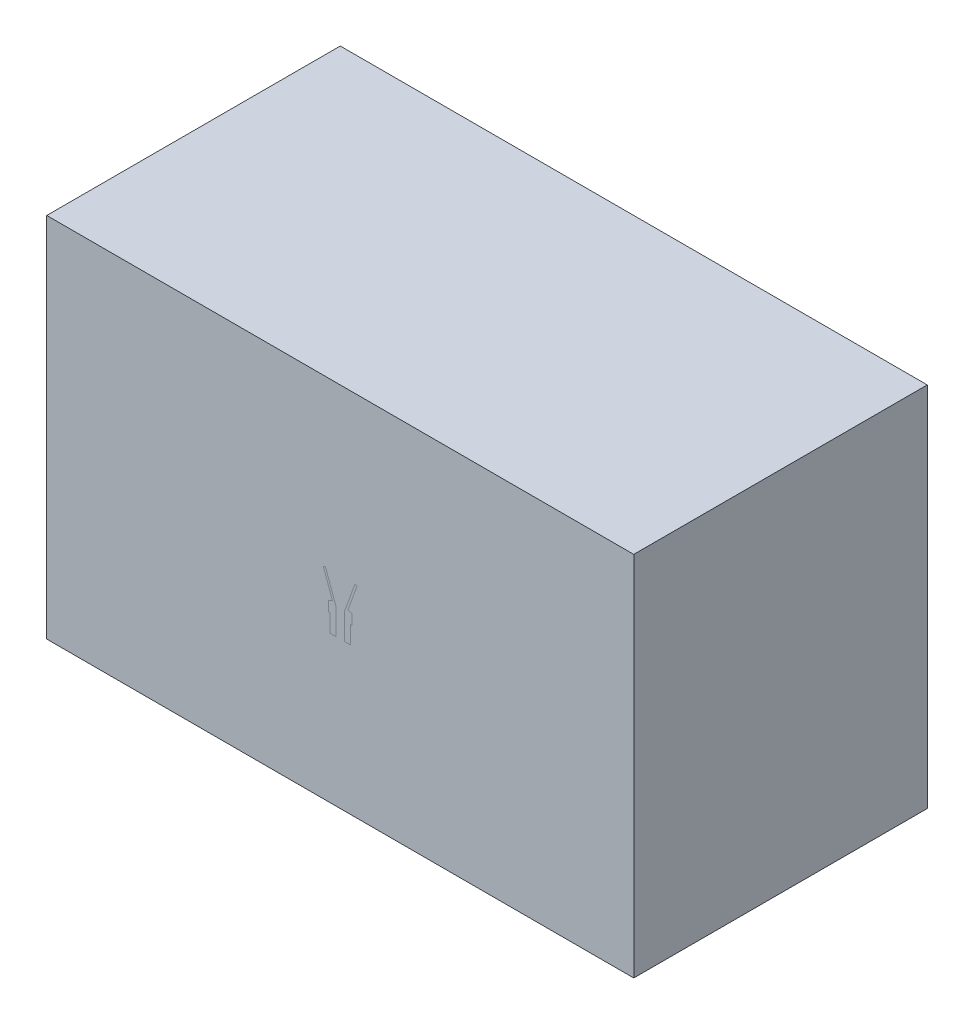
ISO-10303-21;
HEADER;
FILE_DESCRIPTION(('STEP AP214'),'2;1');
FILE_NAME('part.step','',(''),(''),'','','');
FILE_SCHEMA(('AUTOMOTIVE_DESIGN { 1 0 10303 214 1 1 1 1 }'));
ENDSEC;
DATA;
#1=APPLICATION_CONTEXT('core data for automotive mechanical design processes');
#2=APPLICATION_PROTOCOL_DEFINITION('international standard','automotive_design',2000,#1);
#3=PRODUCT_CONTEXT('',#1,'mechanical');
#4=PRODUCT('Part','Part','',(#3));
#5=PRODUCT_RELATED_PRODUCT_CATEGORY('part','',(#4));
#6=PRODUCT_DEFINITION_FORMATION('','',#4);
#7=PRODUCT_DEFINITION_CONTEXT('part definition',#1,'design');
#8=PRODUCT_DEFINITION('design','',#6,#7);
#9=PRODUCT_DEFINITION_SHAPE('','',#8);
#10=(LENGTH_UNIT() NAMED_UNIT(*) SI_UNIT(.MILLI.,.METRE.));
#11=(NAMED_UNIT(*) PLANE_ANGLE_UNIT() SI_UNIT($,.RADIAN.));
#12=(NAMED_UNIT(*) SI_UNIT($,.STERADIAN.) SOLID_ANGLE_UNIT());
#13=UNCERTAINTY_MEASURE_WITH_UNIT(LENGTH_MEASURE(1.E-05),#10,'distance_accuracy_value','');
#14=(GEOMETRIC_REPRESENTATION_CONTEXT(3) GLOBAL_UNCERTAINTY_ASSIGNED_CONTEXT((#13)) GLOBAL_UNIT_ASSIGNED_CONTEXT((#10,
#11,#12)) REPRESENTATION_CONTEXT('',''));
#15=CARTESIAN_POINT('',(0.,0.,0.));
#16=DIRECTION('',(0.,0.,1.));
#17=DIRECTION('',(1.,0.,0.));
#18=AXIS2_PLACEMENT_3D('',#15,#16,#17);
#19=CARTESIAN_POINT('',(0.,457.,0.));
#20=DIRECTION('',(0.,1.,0.));
#21=DIRECTION('',(0.,0.,1.));
#22=AXIS2_PLACEMENT_3D('',#19,#20,#21);
#23=CONICAL_SURFACE('',#22,75.,0.349065850398861);
#24=DIRECTION('',(0.342020143325664,0.93969262078591,0.));
#25=VECTOR('',#24,1.);
#26=CARTESIAN_POINT('',(0.,250.9391935409,0.));
#27=LINE('',#26,#25);
#28=CARTESIAN_POINT('',(257.433544449909,958.232043927204,0.));
#29=VERTEX_POINT('',#28);
#30=CARTESIAN_POINT('',(75.,457.,0.));
#31=VERTEX_POINT('',#30);
#32=EDGE_CURVE('E171',#29,#31,#27,.F.);
#33=ORIENTED_EDGE('',*,*,#32,.F.);
#34=CARTESIAN_POINT('',(0.,958.232043927204,0.));
#35=DIRECTION('',(0.,-1.,0.));
#36=DIRECTION('',(0.,0.,-1.));
#37=AXIS2_PLACEMENT_3D('',#34,#35,#36);
#38=CIRCLE('',#37,257.433544449909);
#39=CARTESIAN_POINT('',(-257.433544449909,958.232043927204,0.));
#40=VERTEX_POINT('',#39);
#41=EDGE_CURVE('E155',#40,#29,#38,.T.);
#42=ORIENTED_EDGE('',*,*,#41,.F.);
#43=DIRECTION('',(0.342020143325664,-0.93969262078591,0.));
#44=VECTOR('',#43,1.);
#45=CARTESIAN_POINT('',(0.,250.9391935409,0.));
#46=LINE('',#45,#44);
#47=CARTESIAN_POINT('',(-75.,457.,0.));
#48=VERTEX_POINT('',#47);
#49=EDGE_CURVE('E136',#48,#40,#46,.F.);
#50=ORIENTED_EDGE('',*,*,#49,.F.);
#51=CARTESIAN_POINT('',(0.,457.,0.));
#52=DIRECTION('',(0.,-1.,0.));
#53=DIRECTION('',(0.,0.,-1.));
#54=AXIS2_PLACEMENT_3D('',#51,#52,#53);
#55=CIRCLE('',#54,75.);
#56=EDGE_CURVE('E124',#48,#31,#55,.T.);
#57=ORIENTED_EDGE('',*,*,#56,.T.);
#58=EDGE_LOOP('',(#33,#42,#50,#57));
#59=FACE_BOUND('',#58,.T.);
#60=ADVANCED_FACE('F49',(#59),#23,.F.);
#61=CARTESIAN_POINT('',(0.,958.232043927204,0.));
#62=DIRECTION('',(0.,-1.,0.));
#63=DIRECTION('',(0.,0.,-1.));
#64=AXIS2_PLACEMENT_3D('',#61,#62,#63);
#65=CONICAL_SURFACE('',#64,257.433544449909,1.22173047639604);
#66=DIRECTION('',(-0.93969262078591,-0.342020143325664,0.));
#67=VECTOR('',#66,1.);
#68=CARTESIAN_POINT('',(0.,1051.93019140862,0.));
#69=LINE('',#68,#67);
#70=CARTESIAN_POINT('',(-293.235833301852,945.201076466497,0.));
#71=VERTEX_POINT('',#70);
#72=EDGE_CURVE('E140',#40,#71,#69,.T.);
#73=ORIENTED_EDGE('',*,*,#72,.F.);
#74=ORIENTED_EDGE('',*,*,#41,.T.);
#75=DIRECTION('',(-0.93969262078591,0.342020143325664,0.));
#76=VECTOR('',#75,1.);
#77=CARTESIAN_POINT('',(0.,1051.93019140862,0.));
#78=LINE('',#77,#76);
#79=CARTESIAN_POINT('',(293.235833301852,945.201076466497,0.));
#80=VERTEX_POINT('',#79);
#81=EDGE_CURVE('E173',#80,#29,#78,.T.);
#82=ORIENTED_EDGE('',*,*,#81,.F.);
#83=CARTESIAN_POINT('',(0.,945.201076466497,0.));
#84=DIRECTION('',(0.,-1.,0.));
#85=DIRECTION('',(0.,0.,-1.));
#86=AXIS2_PLACEMENT_3D('',#83,#84,#85);
#87=CIRCLE('',#86,293.235833301852);
#88=EDGE_CURVE('E152',#71,#80,#87,.T.);
#89=ORIENTED_EDGE('',*,*,#88,.F.);
#90=EDGE_LOOP('',(#73,#74,#82,#89));
#91=FACE_BOUND('',#90,.T.);
#92=ADVANCED_FACE('F199',(#91),#65,.T.);
#93=CARTESIAN_POINT('',(0.,945.201076466497,0.));
#94=DIRECTION('',(0.,1.,0.));
#95=DIRECTION('',(0.,0.,1.));
#96=AXIS2_PLACEMENT_3D('',#93,#94,#95);
#97=CONICAL_SURFACE('',#96,293.235833301852,0.34906585039886);
#98=DIRECTION('',(0.342020143325663,0.93969262078591,0.));
#99=VECTOR('',#98,1.);
#100=CARTESIAN_POINT('',(0.,139.542245894684,0.));
#101=LINE('',#100,#99);
#102=CARTESIAN_POINT('',(133.634704911401,506.700580094249,0.));
#103=VERTEX_POINT('',#102);
#104=EDGE_CURVE('E175',#103,#80,#101,.T.);
#105=ORIENTED_EDGE('',*,*,#104,.F.);
#106=CARTESIAN_POINT('',(0.,506.700580094249,0.));
#107=DIRECTION('',(0.,-1.,0.));
#108=DIRECTION('',(0.,0.,-1.));
#109=AXIS2_PLACEMENT_3D('',#106,#107,#108);
#110=CIRCLE('',#109,133.634704911402);
#111=CARTESIAN_POINT('',(-133.634704911401,506.700580094249,0.));
#112=VERTEX_POINT('',#111);
#113=EDGE_CURVE('E149',#112,#103,#110,.T.);
#114=ORIENTED_EDGE('',*,*,#113,.F.);
#115=DIRECTION('',(0.342020143325663,-0.93969262078591,0.));
#116=VECTOR('',#115,1.);
#117=CARTESIAN_POINT('',(0.,139.542245894684,0.));
#118=LINE('',#117,#116);
#119=EDGE_CURVE('E161',#71,#112,#118,.T.);
#120=ORIENTED_EDGE('',*,*,#119,.F.);
#121=ORIENTED_EDGE('',*,*,#88,.T.);
#122=EDGE_LOOP('',(#105,#114,#120,#121));
#123=FACE_BOUND('',#122,.T.);
#124=ADVANCED_FACE('F205',(#123),#97,.T.);
#125=CARTESIAN_POINT('',(0.,506.700580094249,0.));
#126=DIRECTION('',(0.,-1.,0.));
#127=DIRECTION('',(0.,0.,-1.));
#128=AXIS2_PLACEMENT_3D('',#125,#126,#127);
#129=CONICAL_SURFACE('',#128,133.634704911402,1.22173047639604);
#130=DIRECTION('',(-0.93969262078591,-0.342020143325663,0.));
#131=VECTOR('',#130,1.);
#132=CARTESIAN_POINT('',(0.,555.339634946945,0.));
#133=LINE('',#132,#131);
#134=CARTESIAN_POINT('',(-200.4,482.4,0.));
#135=VERTEX_POINT('',#134);
#136=EDGE_CURVE('E163',#112,#135,#133,.T.);
#137=ORIENTED_EDGE('',*,*,#136,.F.);
#138=ORIENTED_EDGE('',*,*,#113,.T.);
#139=DIRECTION('',(-0.93969262078591,0.342020143325663,0.));
#140=VECTOR('',#139,1.);
#141=CARTESIAN_POINT('',(0.,555.339634946945,0.));
#142=LINE('',#141,#140);
#143=CARTESIAN_POINT('',(200.4,482.4,0.));
#144=VERTEX_POINT('',#143);
#145=EDGE_CURVE('E177',#144,#103,#142,.T.);
#146=ORIENTED_EDGE('',*,*,#145,.F.);
#147=CARTESIAN_POINT('',(0.,482.4,0.));
#148=DIRECTION('',(0.,-1.,0.));
#149=DIRECTION('',(0.,0.,-1.));
#150=AXIS2_PLACEMENT_3D('',#147,#148,#149);
#151=CIRCLE('',#150,200.4);
#152=EDGE_CURVE('E146',#135,#144,#151,.T.);
#153=ORIENTED_EDGE('',*,*,#152,.F.);
#154=EDGE_LOOP('',(#137,#138,#146,#153));
#155=FACE_BOUND('',#154,.T.);
#156=ADVANCED_FACE('F213',(#155),#129,.T.);
#157=CARTESIAN_POINT('',(0.,0.,0.));
#158=DIRECTION('',(0.,-1.,0.));
#159=DIRECTION('',(0.,0.,-1.));
#160=AXIS2_PLACEMENT_3D('',#157,#158,#159);
#161=CYLINDRICAL_SURFACE('',#160,200.4);
#162=DIRECTION('',(0.,-1.,0.));
#163=VECTOR('',#162,1.);
#164=CARTESIAN_POINT('',(-200.4,0.,0.));
#165=LINE('',#164,#163);
#166=CARTESIAN_POINT('',(-200.4,307.,0.));
#167=VERTEX_POINT('',#166);
#168=EDGE_CURVE('E165',#135,#167,#165,.T.);
#169=ORIENTED_EDGE('',*,*,#168,.F.);
#170=ORIENTED_EDGE('',*,*,#152,.T.);
#171=DIRECTION('',(0.,-1.,0.));
#172=VECTOR('',#171,1.);
#173=CARTESIAN_POINT('',(200.4,0.,0.));
#174=LINE('',#173,#172);
#175=CARTESIAN_POINT('',(200.4,307.,0.));
#176=VERTEX_POINT('',#175);
#177=EDGE_CURVE('E131',#176,#144,#174,.F.);
#178=ORIENTED_EDGE('',*,*,#177,.F.);
#179=CARTESIAN_POINT('',(0.,307.,0.));
#180=DIRECTION('',(0.,-1.,0.));
#181=DIRECTION('',(0.,0.,-1.));
#182=AXIS2_PLACEMENT_3D('',#179,#180,#181);
#183=CIRCLE('',#182,200.4);
#184=EDGE_CURVE('E130',#167,#176,#183,.T.);
#185=ORIENTED_EDGE('',*,*,#184,.F.);
#186=EDGE_LOOP('',(#169,#170,#178,#185));
#187=FACE_BOUND('',#186,.T.);
#188=ADVANCED_FACE('F217',(#187),#161,.T.);
#189=CARTESIAN_POINT('',(-175.,307.,0.));
#190=DIRECTION('',(0.,1.,0.));
#191=DIRECTION('',(0.,0.,1.));
#192=AXIS2_PLACEMENT_3D('',#189,#190,#191);
#193=PLANE('',#192);
#194=DIRECTION('',(1.,0.,0.));
#195=VECTOR('',#194,1.);
#196=CARTESIAN_POINT('',(-175.,307.,0.));
#197=LINE('',#196,#195);
#198=CARTESIAN_POINT('',(-175.,307.,0.));
#199=VERTEX_POINT('',#198);
#200=EDGE_CURVE('E71',#167,#199,#197,.T.);
#201=ORIENTED_EDGE('',*,*,#200,.F.);
#202=ORIENTED_EDGE('',*,*,#184,.T.);
#203=CARTESIAN_POINT('',(175.,307.,0.));
#204=VERTEX_POINT('',#203);
#205=EDGE_CURVE('E118',#204,#176,#197,.T.);
#206=ORIENTED_EDGE('',*,*,#205,.F.);
#207=CARTESIAN_POINT('',(0.,307.,0.));
#208=DIRECTION('',(0.,1.,0.));
#209=DIRECTION('',(0.,0.,1.));
#210=AXIS2_PLACEMENT_3D('',#207,#208,#209);
#211=CIRCLE('',#210,175.);
#212=EDGE_CURVE('E128',#204,#199,#211,.T.);
#213=ORIENTED_EDGE('',*,*,#212,.T.);
#214=EDGE_LOOP('',(#201,#202,#206,#213));
#215=FACE_BOUND('',#214,.T.);
#216=ADVANCED_FACE('F51',(#215),#193,.F.);
#217=CARTESIAN_POINT('',(0.,457.,0.));
#218=DIRECTION('',(0.,-1.,0.));
#219=DIRECTION('',(0.,0.,-1.));
#220=AXIS2_PLACEMENT_3D('',#217,#218,#219);
#221=CYLINDRICAL_SURFACE('',#220,75.);
#222=ORIENTED_EDGE('',*,*,#56,.F.);
#223=DIRECTION('',(0.,-1.,0.));
#224=VECTOR('',#223,1.);
#225=CARTESIAN_POINT('',(-75.,457.,0.));
#226=LINE('',#225,#224);
#227=CARTESIAN_POINT('',(-75.,0.,0.));
#228=VERTEX_POINT('',#227);
#229=EDGE_CURVE('E167',#48,#228,#226,.T.);
#230=ORIENTED_EDGE('',*,*,#229,.T.);
#231=CARTESIAN_POINT('',(0.,0.,0.));
#232=DIRECTION('',(0.,1.,0.));
#233=DIRECTION('',(0.,0.,1.));
#234=AXIS2_PLACEMENT_3D('',#231,#232,#233);
#235=CIRCLE('',#234,75.);
#236=CARTESIAN_POINT('',(75.,0.,0.));
#237=VERTEX_POINT('',#236);
#238=EDGE_CURVE('E138',#237,#228,#235,.T.);
#239=ORIENTED_EDGE('',*,*,#238,.F.);
#240=DIRECTION('',(0.,-1.,0.));
#241=VECTOR('',#240,1.);
#242=CARTESIAN_POINT('',(75.,457.,0.));
#243=LINE('',#242,#241);
#244=EDGE_CURVE('E132',#237,#31,#243,.F.);
#245=ORIENTED_EDGE('',*,*,#244,.T.);
#246=EDGE_LOOP('',(#222,#230,#239,#245));
#247=FACE_BOUND('',#246,.T.);
#248=ADVANCED_FACE('F189',(#247),#221,.F.);
#249=CARTESIAN_POINT('',(0.,0.,0.));
#250=DIRECTION('',(0.,1.,0.));
#251=DIRECTION('',(0.,0.,1.));
#252=AXIS2_PLACEMENT_3D('',#249,#250,#251);
#253=PLANE('',#252);
#254=DIRECTION('',(1.,0.,0.));
#255=VECTOR('',#254,1.);
#256=CARTESIAN_POINT('',(0.,0.,0.));
#257=LINE('',#256,#255);
#258=CARTESIAN_POINT('',(-175.,0.,0.));
#259=VERTEX_POINT('',#258);
#260=EDGE_CURVE('E170',#259,#228,#257,.T.);
#261=ORIENTED_EDGE('',*,*,#260,.F.);
#262=CARTESIAN_POINT('',(0.,0.,0.));
#263=DIRECTION('',(0.,1.,0.));
#264=DIRECTION('',(0.,0.,1.));
#265=AXIS2_PLACEMENT_3D('',#262,#263,#264);
#266=CIRCLE('',#265,175.);
#267=CARTESIAN_POINT('',(175.,0.,0.));
#268=VERTEX_POINT('',#267);
#269=EDGE_CURVE('E135',#268,#259,#266,.T.);
#270=ORIENTED_EDGE('',*,*,#269,.F.);
#271=EDGE_CURVE('E64',#237,#268,#257,.T.);
#272=ORIENTED_EDGE('',*,*,#271,.F.);
#273=ORIENTED_EDGE('',*,*,#238,.T.);
#274=EDGE_LOOP('',(#261,#270,#272,#273));
#275=FACE_BOUND('',#274,.T.);
#276=ADVANCED_FACE('F190',(#275),#253,.F.);
#277=CARTESIAN_POINT('',(0.,457.,0.));
#278=DIRECTION('',(0.,-1.,0.));
#279=DIRECTION('',(0.,0.,-1.));
#280=AXIS2_PLACEMENT_3D('',#277,#278,#279);
#281=CYLINDRICAL_SURFACE('',#280,175.);
#282=DIRECTION('',(0.,-1.,0.));
#283=VECTOR('',#282,1.);
#284=CARTESIAN_POINT('',(-175.,457.,0.));
#285=LINE('',#284,#283);
#286=EDGE_CURVE('E12',#199,#259,#285,.T.);
#287=ORIENTED_EDGE('',*,*,#286,.F.);
#288=ORIENTED_EDGE('',*,*,#212,.F.);
#289=DIRECTION('',(0.,-1.,0.));
#290=VECTOR('',#289,1.);
#291=CARTESIAN_POINT('',(175.,457.,0.));
#292=LINE('',#291,#290);
#293=EDGE_CURVE('E57',#268,#204,#292,.F.);
#294=ORIENTED_EDGE('',*,*,#293,.F.);
#295=ORIENTED_EDGE('',*,*,#269,.T.);
#296=EDGE_LOOP('',(#287,#288,#294,#295));
#297=FACE_BOUND('',#296,.T.);
#298=ADVANCED_FACE('F134',(#297),#281,.T.);
#299=CARTESIAN_POINT('',(0.,0.,0.));
#300=DIRECTION('',(0.,0.,1.));
#301=DIRECTION('',(1.,0.,0.));
#302=AXIS2_PLACEMENT_3D('',#299,#300,#301);
#303=PLANE('',#302);
#304=ORIENTED_EDGE('',*,*,#32,.T.);
#305=ORIENTED_EDGE('',*,*,#244,.F.);
#306=ORIENTED_EDGE('',*,*,#271,.T.);
#307=ORIENTED_EDGE('',*,*,#293,.T.);
#308=ORIENTED_EDGE('',*,*,#205,.T.);
#309=ORIENTED_EDGE('',*,*,#177,.T.);
#310=ORIENTED_EDGE('',*,*,#145,.T.);
#311=ORIENTED_EDGE('',*,*,#104,.T.);
#312=ORIENTED_EDGE('',*,*,#81,.T.);
#313=EDGE_LOOP('',(#304,#305,#306,#307,#308,#309,#310,#311,#312));
#314=FACE_BOUND('',#313,.T.);
#315=ADVANCED_FACE('F117',(#314),#303,.T.);
#316=ORIENTED_EDGE('',*,*,#49,.T.);
#317=ORIENTED_EDGE('',*,*,#72,.T.);
#318=ORIENTED_EDGE('',*,*,#119,.T.);
#319=ORIENTED_EDGE('',*,*,#136,.T.);
#320=ORIENTED_EDGE('',*,*,#168,.T.);
#321=ORIENTED_EDGE('',*,*,#200,.T.);
#322=ORIENTED_EDGE('',*,*,#286,.T.);
#323=ORIENTED_EDGE('',*,*,#260,.T.);
#324=ORIENTED_EDGE('',*,*,#229,.F.);
#325=EDGE_LOOP('',(#316,#317,#318,#319,#320,#321,#322,#323,#324));
#326=FACE_BOUND('',#325,.T.);
#327=ADVANCED_FACE('F183',(#326),#303,.T.);
#328=CLOSED_SHELL('',(#60,#92,#124,#156,#188,#216,#248,#276,#298,#315,#327));
#329=MANIFOLD_SOLID_BREP('B2',#328);
#330=CARTESIAN_POINT('',(5080.,-2540.,5080.));
#331=DIRECTION('',(0.,1.,0.));
#332=DIRECTION('',(0.,0.,1.));
#333=AXIS2_PLACEMENT_3D('',#330,#331,#332);
#334=PLANE('',#333);
#335=DIRECTION('',(1.,0.,0.));
#336=VECTOR('',#335,1.);
#337=CARTESIAN_POINT('',(5080.,-2540.,0.));
#338=LINE('',#337,#336);
#339=CARTESIAN_POINT('',(-5080.,-2540.,0.));
#340=VERTEX_POINT('',#339);
#341=CARTESIAN_POINT('',(5080.,-2540.,0.));
#342=VERTEX_POINT('',#341);
#343=EDGE_CURVE('E481',#340,#342,#338,.T.);
#344=ORIENTED_EDGE('',*,*,#343,.F.);
#345=DIRECTION('',(0.,0.,-1.));
#346=VECTOR('',#345,1.);
#347=CARTESIAN_POINT('',(-5080.,-2540.,5080.));
#348=LINE('',#347,#346);
#349=CARTESIAN_POINT('',(-5080.,-2540.,-5080.));
#350=VERTEX_POINT('',#349);
#351=EDGE_CURVE('E466',#340,#350,#348,.T.);
#352=ORIENTED_EDGE('',*,*,#351,.T.);
#353=DIRECTION('',(-1.,0.,0.));
#354=VECTOR('',#353,1.);
#355=CARTESIAN_POINT('',(5080.,-2540.,-5080.));
#356=LINE('',#355,#354);
#357=CARTESIAN_POINT('',(5080.,-2540.,-5080.));
#358=VERTEX_POINT('',#357);
#359=EDGE_CURVE('E425',#358,#350,#356,.T.);
#360=ORIENTED_EDGE('',*,*,#359,.F.);
#361=DIRECTION('',(0.,0.,-1.));
#362=VECTOR('',#361,1.);
#363=CARTESIAN_POINT('',(5080.,-2540.,5080.));
#364=LINE('',#363,#362);
#365=EDGE_CURVE('E462',#342,#358,#364,.T.);
#366=ORIENTED_EDGE('',*,*,#365,.F.);
#367=EDGE_LOOP('',(#344,#352,#360,#366));
#368=FACE_BOUND('',#367,.T.);
#369=ADVANCED_FACE('F303',(#368),#334,.F.);
#370=CARTESIAN_POINT('',(5080.,3810.00000000001,5080.));
#371=DIRECTION('',(0.,-1.,0.));
#372=DIRECTION('',(0.,0.,-1.));
#373=AXIS2_PLACEMENT_3D('',#370,#371,#372);
#374=PLANE('',#373);
#375=DIRECTION('',(-1.,0.,0.));
#376=VECTOR('',#375,1.);
#377=CARTESIAN_POINT('',(5080.,3810.,0.));
#378=LINE('',#377,#376);
#379=CARTESIAN_POINT('',(5080.,3810.,0.));
#380=VERTEX_POINT('',#379);
#381=CARTESIAN_POINT('',(-5080.,3810.,1.77635683940025E-12));
#382=VERTEX_POINT('',#381);
#383=EDGE_CURVE('E319',#380,#382,#378,.T.);
#384=ORIENTED_EDGE('',*,*,#383,.F.);
#385=DIRECTION('',(0.,0.,1.));
#386=VECTOR('',#385,1.);
#387=CARTESIAN_POINT('',(5080.,3810.00000000001,5080.));
#388=LINE('',#387,#386);
#389=CARTESIAN_POINT('',(5080.,3810.,-5080.));
#390=VERTEX_POINT('',#389);
#391=EDGE_CURVE('E457',#390,#380,#388,.T.);
#392=ORIENTED_EDGE('',*,*,#391,.F.);
#393=DIRECTION('',(-1.,0.,0.));
#394=VECTOR('',#393,1.);
#395=CARTESIAN_POINT('',(5080.,3810.,-5080.));
#396=LINE('',#395,#394);
#397=CARTESIAN_POINT('',(-5080.,3810.,-5080.));
#398=VERTEX_POINT('',#397);
#399=EDGE_CURVE('E453',#390,#398,#396,.T.);
#400=ORIENTED_EDGE('',*,*,#399,.T.);
#401=DIRECTION('',(0.,0.,1.));
#402=VECTOR('',#401,1.);
#403=CARTESIAN_POINT('',(-5080.,3810.00000000001,5080.));
#404=LINE('',#403,#402);
#405=EDGE_CURVE('E458',#398,#382,#404,.T.);
#406=ORIENTED_EDGE('',*,*,#405,.T.);
#407=EDGE_LOOP('',(#384,#392,#400,#406));
#408=FACE_BOUND('',#407,.T.);
#409=ADVANCED_FACE('F570',(#408),#374,.F.);
#410=CARTESIAN_POINT('',(5080.,0.,0.));
#411=DIRECTION('',(1.,0.,0.));
#412=DIRECTION('',(0.,0.,-1.));
#413=AXIS2_PLACEMENT_3D('',#410,#411,#412);
#414=PLANE('',#413);
#415=ORIENTED_EDGE('',*,*,#391,.T.);
#416=DIRECTION('',(0.,-1.,0.));
#417=VECTOR('',#416,1.);
#418=CARTESIAN_POINT('',(5080.,0.,0.));
#419=LINE('',#418,#417);
#420=EDGE_CURVE('E469',#380,#342,#419,.T.);
#421=ORIENTED_EDGE('',*,*,#420,.T.);
#422=ORIENTED_EDGE('',*,*,#365,.T.);
#423=DIRECTION('',(0.,1.,0.));
#424=VECTOR('',#423,1.);
#425=CARTESIAN_POINT('',(5080.,3810.,-5080.));
#426=LINE('',#425,#424);
#427=EDGE_CURVE('E473',#358,#390,#426,.T.);
#428=ORIENTED_EDGE('',*,*,#427,.T.);
#429=EDGE_LOOP('',(#415,#421,#422,#428));
#430=FACE_BOUND('',#429,.T.);
#431=ADVANCED_FACE('F576',(#430),#414,.T.);
#432=CARTESIAN_POINT('',(-5080.,0.,0.));
#433=DIRECTION('',(1.,0.,0.));
#434=DIRECTION('',(0.,0.,-1.));
#435=AXIS2_PLACEMENT_3D('',#432,#433,#434);
#436=PLANE('',#435);
#437=DIRECTION('',(0.,-1.,0.));
#438=VECTOR('',#437,1.);
#439=CARTESIAN_POINT('',(-5080.,0.,0.));
#440=LINE('',#439,#438);
#441=EDGE_CURVE('E486',#382,#340,#440,.T.);
#442=ORIENTED_EDGE('',*,*,#441,.F.);
#443=ORIENTED_EDGE('',*,*,#405,.F.);
#444=DIRECTION('',(0.,1.,0.));
#445=VECTOR('',#444,1.);
#446=CARTESIAN_POINT('',(-5080.,3810.,-5080.));
#447=LINE('',#446,#445);
#448=EDGE_CURVE('E463',#350,#398,#447,.T.);
#449=ORIENTED_EDGE('',*,*,#448,.F.);
#450=ORIENTED_EDGE('',*,*,#351,.F.);
#451=EDGE_LOOP('',(#442,#443,#449,#450));
#452=FACE_BOUND('',#451,.T.);
#453=ADVANCED_FACE('F583',(#452),#436,.F.);
#454=CARTESIAN_POINT('',(5080.,3810.,-5080.));
#455=DIRECTION('',(0.,0.,1.));
#456=DIRECTION('',(0.,-1.,0.));
#457=AXIS2_PLACEMENT_3D('',#454,#455,#456);
#458=PLANE('',#457);
#459=ORIENTED_EDGE('',*,*,#448,.T.);
#460=ORIENTED_EDGE('',*,*,#399,.F.);
#461=ORIENTED_EDGE('',*,*,#427,.F.);
#462=ORIENTED_EDGE('',*,*,#359,.T.);
#463=EDGE_LOOP('',(#459,#460,#461,#462));
#464=FACE_BOUND('',#463,.T.);
#465=ADVANCED_FACE('F581',(#464),#458,.F.);
#466=CARTESIAN_POINT('',(0.,0.,0.));
#467=DIRECTION('',(0.,0.,1.));
#468=DIRECTION('',(1.,0.,0.));
#469=AXIS2_PLACEMENT_3D('',#466,#467,#468);
#470=PLANE('',#469);
#471=ORIENTED_EDGE('',*,*,#383,.T.);
#472=ORIENTED_EDGE('',*,*,#441,.T.);
#473=ORIENTED_EDGE('',*,*,#343,.T.);
#474=ORIENTED_EDGE('',*,*,#420,.F.);
#475=EDGE_LOOP('',(#471,#472,#473,#474));
#476=FACE_BOUND('',#475,.T.);
#477=DIRECTION('',(0.,-1.,0.));
#478=VECTOR('',#477,1.);
#479=CARTESIAN_POINT('',(-75.,457.,0.));
#480=LINE('',#479,#478);
#481=CARTESIAN_POINT('',(-75.,457.,0.));
#482=VERTEX_POINT('',#481);
#483=CARTESIAN_POINT('',(-75.,0.,0.));
#484=VERTEX_POINT('',#483);
#485=EDGE_CURVE('E510',#482,#484,#480,.T.);
#486=ORIENTED_EDGE('',*,*,#485,.T.);
#487=DIRECTION('',(1.,0.,0.));
#488=VECTOR('',#487,1.);
#489=CARTESIAN_POINT('',(0.,0.,0.));
#490=LINE('',#489,#488);
#491=CARTESIAN_POINT('',(-175.,0.,0.));
#492=VERTEX_POINT('',#491);
#493=EDGE_CURVE('E417',#492,#484,#490,.T.);
#494=ORIENTED_EDGE('',*,*,#493,.F.);
#495=DIRECTION('',(0.,-1.,0.));
#496=VECTOR('',#495,1.);
#497=CARTESIAN_POINT('',(-175.,457.,0.));
#498=LINE('',#497,#496);
#499=CARTESIAN_POINT('',(-175.,307.,0.));
#500=VERTEX_POINT('',#499);
#501=EDGE_CURVE('E47',#500,#492,#498,.T.);
#502=ORIENTED_EDGE('',*,*,#501,.F.);
#503=DIRECTION('',(1.,0.,0.));
#504=VECTOR('',#503,1.);
#505=CARTESIAN_POINT('',(-175.,307.,0.));
#506=LINE('',#505,#504);
#507=CARTESIAN_POINT('',(-200.4,307.,0.));
#508=VERTEX_POINT('',#507);
#509=EDGE_CURVE('E509',#508,#500,#506,.T.);
#510=ORIENTED_EDGE('',*,*,#509,.F.);
#511=DIRECTION('',(0.,-1.,0.));
#512=VECTOR('',#511,1.);
#513=CARTESIAN_POINT('',(-200.4,0.,0.));
#514=LINE('',#513,#512);
#515=CARTESIAN_POINT('',(-200.4,482.4,0.));
#516=VERTEX_POINT('',#515);
#517=EDGE_CURVE('E505',#516,#508,#514,.T.);
#518=ORIENTED_EDGE('',*,*,#517,.F.);
#519=DIRECTION('',(-0.93969262078591,-0.342020143325663,0.));
#520=VECTOR('',#519,1.);
#521=CARTESIAN_POINT('',(0.,555.339634946945,0.));
#522=LINE('',#521,#520);
#523=CARTESIAN_POINT('',(-133.634704911401,506.700580094249,0.));
#524=VERTEX_POINT('',#523);
#525=EDGE_CURVE('E501',#524,#516,#522,.T.);
#526=ORIENTED_EDGE('',*,*,#525,.F.);
#527=DIRECTION('',(0.342020143325663,-0.93969262078591,0.));
#528=VECTOR('',#527,1.);
#529=CARTESIAN_POINT('',(0.,139.542245894684,0.));
#530=LINE('',#529,#528);
#531=CARTESIAN_POINT('',(-293.235833301852,945.201076466497,0.));
#532=VERTEX_POINT('',#531);
#533=EDGE_CURVE('E497',#532,#524,#530,.T.);
#534=ORIENTED_EDGE('',*,*,#533,.F.);
#535=DIRECTION('',(-0.93969262078591,-0.342020143325664,0.));
#536=VECTOR('',#535,1.);
#537=CARTESIAN_POINT('',(0.,1051.93019140862,0.));
#538=LINE('',#537,#536);
#539=CARTESIAN_POINT('',(-257.433544449909,958.232043927204,0.));
#540=VERTEX_POINT('',#539);
#541=EDGE_CURVE('E493',#540,#532,#538,.T.);
#542=ORIENTED_EDGE('',*,*,#541,.F.);
#543=DIRECTION('',(0.342020143325664,-0.93969262078591,0.));
#544=VECTOR('',#543,1.);
#545=CARTESIAN_POINT('',(0.,250.9391935409,0.));
#546=LINE('',#545,#544);
#547=EDGE_CURVE('E489',#482,#540,#546,.F.);
#548=ORIENTED_EDGE('',*,*,#547,.F.);
#549=EDGE_LOOP('',(#486,#494,#502,#510,#518,#526,#534,#542,#548));
#550=FACE_BOUND('',#549,.T.);
#551=DIRECTION('',(-0.93969262078591,0.342020143325664,0.));
#552=VECTOR('',#551,1.);
#553=CARTESIAN_POINT('',(0.,1051.93019140862,0.));
#554=LINE('',#553,#552);
#555=CARTESIAN_POINT('',(293.235833301852,945.201076466497,0.));
#556=VERTEX_POINT('',#555);
#557=CARTESIAN_POINT('',(257.433544449909,958.232043927204,0.));
#558=VERTEX_POINT('',#557);
#559=EDGE_CURVE('E517',#556,#558,#554,.T.);
#560=ORIENTED_EDGE('',*,*,#559,.F.);
#561=DIRECTION('',(0.342020143325663,0.93969262078591,0.));
#562=VECTOR('',#561,1.);
#563=CARTESIAN_POINT('',(0.,139.542245894684,0.));
#564=LINE('',#563,#562);
#565=CARTESIAN_POINT('',(133.634704911401,506.700580094249,0.));
#566=VERTEX_POINT('',#565);
#567=EDGE_CURVE('E521',#566,#556,#564,.T.);
#568=ORIENTED_EDGE('',*,*,#567,.F.);
#569=DIRECTION('',(-0.93969262078591,0.342020143325663,0.));
#570=VECTOR('',#569,1.);
#571=CARTESIAN_POINT('',(0.,555.339634946945,0.));
#572=LINE('',#571,#570);
#573=CARTESIAN_POINT('',(200.4,482.4,0.));
#574=VERTEX_POINT('',#573);
#575=EDGE_CURVE('E525',#574,#566,#572,.T.);
#576=ORIENTED_EDGE('',*,*,#575,.F.);
#577=DIRECTION('',(0.,-1.,0.));
#578=VECTOR('',#577,1.);
#579=CARTESIAN_POINT('',(200.4,0.,0.));
#580=LINE('',#579,#578);
#581=CARTESIAN_POINT('',(200.4,307.,0.));
#582=VERTEX_POINT('',#581);
#583=EDGE_CURVE('E529',#582,#574,#580,.F.);
#584=ORIENTED_EDGE('',*,*,#583,.F.);
#585=CARTESIAN_POINT('',(175.,307.,0.));
#586=VERTEX_POINT('',#585);
#587=EDGE_CURVE('E327',#586,#582,#506,.T.);
#588=ORIENTED_EDGE('',*,*,#587,.F.);
#589=DIRECTION('',(0.,-1.,0.));
#590=VECTOR('',#589,1.);
#591=CARTESIAN_POINT('',(175.,457.,0.));
#592=LINE('',#591,#590);
#593=CARTESIAN_POINT('',(175.,0.,0.));
#594=VERTEX_POINT('',#593);
#595=EDGE_CURVE('E312',#594,#586,#592,.F.);
#596=ORIENTED_EDGE('',*,*,#595,.F.);
#597=CARTESIAN_POINT('',(75.,0.,0.));
#598=VERTEX_POINT('',#597);
#599=EDGE_CURVE('E398',#598,#594,#490,.T.);
#600=ORIENTED_EDGE('',*,*,#599,.F.);
#601=DIRECTION('',(0.,-1.,0.));
#602=VECTOR('',#601,1.);
#603=CARTESIAN_POINT('',(75.,457.,0.));
#604=LINE('',#603,#602);
#605=CARTESIAN_POINT('',(75.,457.,0.));
#606=VERTEX_POINT('',#605);
#607=EDGE_CURVE('E415',#598,#606,#604,.F.);
#608=ORIENTED_EDGE('',*,*,#607,.T.);
#609=DIRECTION('',(0.342020143325664,0.93969262078591,0.));
#610=VECTOR('',#609,1.);
#611=CARTESIAN_POINT('',(0.,250.9391935409,0.));
#612=LINE('',#611,#610);
#613=EDGE_CURVE('E513',#558,#606,#612,.F.);
#614=ORIENTED_EDGE('',*,*,#613,.F.);
#615=EDGE_LOOP('',(#560,#568,#576,#584,#588,#596,#600,#608,#614));
#616=FACE_BOUND('',#615,.T.);
#617=ADVANCED_FACE('F397',(#476,#550,#616),#470,.T.);
#618=CARTESIAN_POINT('',(0.,457.,0.));
#619=DIRECTION('',(0.,1.,0.));
#620=DIRECTION('',(0.,0.,1.));
#621=AXIS2_PLACEMENT_3D('',#618,#619,#620);
#622=CONICAL_SURFACE('',#621,75.,0.349065850398861);
#623=CARTESIAN_POINT('',(0.,958.232043927204,0.));
#624=DIRECTION('',(0.,-1.,0.));
#625=DIRECTION('',(0.,0.,-1.));
#626=AXIS2_PLACEMENT_3D('',#623,#624,#625);
#627=CIRCLE('',#626,257.433544449909);
#628=EDGE_CURVE('E443',#540,#558,#627,.T.);
#629=ORIENTED_EDGE('',*,*,#628,.T.);
#630=ORIENTED_EDGE('',*,*,#613,.T.);
#631=CARTESIAN_POINT('',(0.,457.,0.));
#632=DIRECTION('',(0.,-1.,0.));
#633=DIRECTION('',(0.,0.,-1.));
#634=AXIS2_PLACEMENT_3D('',#631,#632,#633);
#635=CIRCLE('',#634,75.);
#636=EDGE_CURVE('E405',#482,#606,#635,.T.);
#637=ORIENTED_EDGE('',*,*,#636,.F.);
#638=ORIENTED_EDGE('',*,*,#547,.T.);
#639=EDGE_LOOP('',(#629,#630,#637,#638));
#640=FACE_BOUND('',#639,.T.);
#641=ADVANCED_FACE('F539',(#640),#622,.T.);
#642=CARTESIAN_POINT('',(0.,958.232043927204,0.));
#643=DIRECTION('',(0.,-1.,0.));
#644=DIRECTION('',(0.,0.,-1.));
#645=AXIS2_PLACEMENT_3D('',#642,#643,#644);
#646=CONICAL_SURFACE('',#645,257.433544449909,1.22173047639604);
#647=ORIENTED_EDGE('',*,*,#628,.F.);
#648=ORIENTED_EDGE('',*,*,#541,.T.);
#649=CARTESIAN_POINT('',(0.,945.201076466497,0.));
#650=DIRECTION('',(0.,-1.,0.));
#651=DIRECTION('',(0.,0.,-1.));
#652=AXIS2_PLACEMENT_3D('',#649,#650,#651);
#653=CIRCLE('',#652,293.235833301852);
#654=EDGE_CURVE('E439',#532,#556,#653,.T.);
#655=ORIENTED_EDGE('',*,*,#654,.T.);
#656=ORIENTED_EDGE('',*,*,#559,.T.);
#657=EDGE_LOOP('',(#647,#648,#655,#656));
#658=FACE_BOUND('',#657,.T.);
#659=ADVANCED_FACE('F560',(#658),#646,.F.);
#660=CARTESIAN_POINT('',(0.,945.201076466497,0.));
#661=DIRECTION('',(0.,1.,0.));
#662=DIRECTION('',(0.,0.,1.));
#663=AXIS2_PLACEMENT_3D('',#660,#661,#662);
#664=CONICAL_SURFACE('',#663,293.235833301852,0.34906585039886);
#665=CARTESIAN_POINT('',(0.,506.700580094249,0.));
#666=DIRECTION('',(0.,-1.,0.));
#667=DIRECTION('',(0.,0.,-1.));
#668=AXIS2_PLACEMENT_3D('',#665,#666,#667);
#669=CIRCLE('',#668,133.634704911402);
#670=EDGE_CURVE('E435',#524,#566,#669,.T.);
#671=ORIENTED_EDGE('',*,*,#670,.T.);
#672=ORIENTED_EDGE('',*,*,#567,.T.);
#673=ORIENTED_EDGE('',*,*,#654,.F.);
#674=ORIENTED_EDGE('',*,*,#533,.T.);
#675=EDGE_LOOP('',(#671,#672,#673,#674));
#676=FACE_BOUND('',#675,.T.);
#677=ADVANCED_FACE('F558',(#676),#664,.F.);
#678=CARTESIAN_POINT('',(0.,506.700580094249,0.));
#679=DIRECTION('',(0.,-1.,0.));
#680=DIRECTION('',(0.,0.,-1.));
#681=AXIS2_PLACEMENT_3D('',#678,#679,#680);
#682=CONICAL_SURFACE('',#681,133.634704911402,1.22173047639604);
#683=ORIENTED_EDGE('',*,*,#670,.F.);
#684=ORIENTED_EDGE('',*,*,#525,.T.);
#685=CARTESIAN_POINT('',(0.,482.4,0.));
#686=DIRECTION('',(0.,-1.,0.));
#687=DIRECTION('',(0.,0.,-1.));
#688=AXIS2_PLACEMENT_3D('',#685,#686,#687);
#689=CIRCLE('',#688,200.4);
#690=EDGE_CURVE('E431',#516,#574,#689,.T.);
#691=ORIENTED_EDGE('',*,*,#690,.T.);
#692=ORIENTED_EDGE('',*,*,#575,.T.);
#693=EDGE_LOOP('',(#683,#684,#691,#692));
#694=FACE_BOUND('',#693,.T.);
#695=ADVANCED_FACE('F555',(#694),#682,.F.);
#696=CARTESIAN_POINT('',(0.,0.,0.));
#697=DIRECTION('',(0.,-1.,0.));
#698=DIRECTION('',(0.,0.,-1.));
#699=AXIS2_PLACEMENT_3D('',#696,#697,#698);
#700=CYLINDRICAL_SURFACE('',#699,200.4);
#701=ORIENTED_EDGE('',*,*,#690,.F.);
#702=ORIENTED_EDGE('',*,*,#517,.T.);
#703=CARTESIAN_POINT('',(0.,307.,0.));
#704=DIRECTION('',(0.,-1.,0.));
#705=DIRECTION('',(0.,0.,-1.));
#706=AXIS2_PLACEMENT_3D('',#703,#704,#705);
#707=CIRCLE('',#706,200.4);
#708=EDGE_CURVE('E423',#508,#582,#707,.T.);
#709=ORIENTED_EDGE('',*,*,#708,.T.);
#710=ORIENTED_EDGE('',*,*,#583,.T.);
#711=EDGE_LOOP('',(#701,#702,#709,#710));
#712=FACE_BOUND('',#711,.T.);
#713=ADVANCED_FACE('F552',(#712),#700,.F.);
#714=CARTESIAN_POINT('',(-175.,307.,0.));
#715=DIRECTION('',(0.,1.,0.));
#716=DIRECTION('',(0.,0.,1.));
#717=AXIS2_PLACEMENT_3D('',#714,#715,#716);
#718=PLANE('',#717);
#719=ORIENTED_EDGE('',*,*,#708,.F.);
#720=ORIENTED_EDGE('',*,*,#509,.T.);
#721=CARTESIAN_POINT('',(0.,307.,0.));
#722=DIRECTION('',(0.,1.,0.));
#723=DIRECTION('',(0.,0.,1.));
#724=AXIS2_PLACEMENT_3D('',#721,#722,#723);
#725=CIRCLE('',#724,175.);
#726=EDGE_CURVE('E419',#586,#500,#725,.T.);
#727=ORIENTED_EDGE('',*,*,#726,.F.);
#728=ORIENTED_EDGE('',*,*,#587,.T.);
#729=EDGE_LOOP('',(#719,#720,#727,#728));
#730=FACE_BOUND('',#729,.T.);
#731=ADVANCED_FACE('F549',(#730),#718,.T.);
#732=CARTESIAN_POINT('',(0.,457.,0.));
#733=DIRECTION('',(0.,-1.,0.));
#734=DIRECTION('',(0.,0.,-1.));
#735=AXIS2_PLACEMENT_3D('',#732,#733,#734);
#736=CYLINDRICAL_SURFACE('',#735,75.);
#737=ORIENTED_EDGE('',*,*,#485,.F.);
#738=ORIENTED_EDGE('',*,*,#636,.T.);
#739=ORIENTED_EDGE('',*,*,#607,.F.);
#740=CARTESIAN_POINT('',(0.,0.,0.));
#741=DIRECTION('',(0.,1.,0.));
#742=DIRECTION('',(0.,0.,1.));
#743=AXIS2_PLACEMENT_3D('',#740,#741,#742);
#744=CIRCLE('',#743,75.);
#745=EDGE_CURVE('E413',#598,#484,#744,.T.);
#746=ORIENTED_EDGE('',*,*,#745,.T.);
#747=EDGE_LOOP('',(#737,#738,#739,#746));
#748=FACE_BOUND('',#747,.T.);
#749=ADVANCED_FACE('F542',(#748),#736,.T.);
#750=CARTESIAN_POINT('',(0.,0.,0.));
#751=DIRECTION('',(0.,1.,0.));
#752=DIRECTION('',(0.,0.,1.));
#753=AXIS2_PLACEMENT_3D('',#750,#751,#752);
#754=PLANE('',#753);
#755=CARTESIAN_POINT('',(0.,0.,0.));
#756=DIRECTION('',(0.,1.,0.));
#757=DIRECTION('',(0.,0.,1.));
#758=AXIS2_PLACEMENT_3D('',#755,#756,#757);
#759=CIRCLE('',#758,175.);
#760=EDGE_CURVE('E411',#594,#492,#759,.T.);
#761=ORIENTED_EDGE('',*,*,#760,.T.);
#762=ORIENTED_EDGE('',*,*,#493,.T.);
#763=ORIENTED_EDGE('',*,*,#745,.F.);
#764=ORIENTED_EDGE('',*,*,#599,.T.);
#765=EDGE_LOOP('',(#761,#762,#763,#764));
#766=FACE_BOUND('',#765,.T.);
#767=ADVANCED_FACE('F409',(#766),#754,.T.);
#768=CARTESIAN_POINT('',(0.,457.,0.));
#769=DIRECTION('',(0.,-1.,0.));
#770=DIRECTION('',(0.,0.,-1.));
#771=AXIS2_PLACEMENT_3D('',#768,#769,#770);
#772=CYLINDRICAL_SURFACE('',#771,175.);
#773=ORIENTED_EDGE('',*,*,#726,.T.);
#774=ORIENTED_EDGE('',*,*,#501,.T.);
#775=ORIENTED_EDGE('',*,*,#760,.F.);
#776=ORIENTED_EDGE('',*,*,#595,.T.);
#777=EDGE_LOOP('',(#773,#774,#775,#776));
#778=FACE_BOUND('',#777,.T.);
#779=ADVANCED_FACE('F305',(#778),#772,.F.);
#780=CLOSED_SHELL('',(#369,#409,#431,#453,#465,#617,#641,#659,#677,#695,#713,#731,#749,#767,#779));
#781=MANIFOLD_SOLID_BREP('B6',#780);
#782=ADVANCED_BREP_SHAPE_REPRESENTATION('',(#18,#329,#781),#14);
#783=SHAPE_DEFINITION_REPRESENTATION(#9,#782);
ENDSEC;
END-ISO-10303-21;
